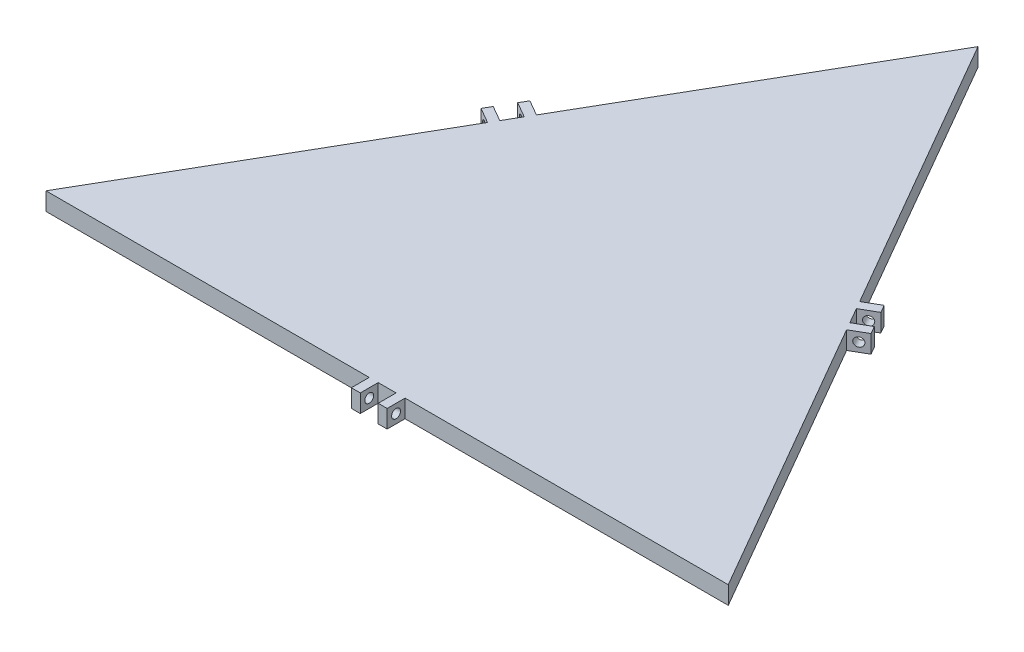
ISO-10303-21;
HEADER;
FILE_DESCRIPTION(('STEP AP214'),'2;1');
FILE_NAME('part.step','',(''),(''),'','','');
FILE_SCHEMA(('AUTOMOTIVE_DESIGN { 1 0 10303 214 1 1 1 1 }'));
ENDSEC;
DATA;
#1=APPLICATION_CONTEXT('core data for automotive mechanical design processes');
#2=APPLICATION_PROTOCOL_DEFINITION('international standard','automotive_design',2000,#1);
#3=PRODUCT_CONTEXT('',#1,'mechanical');
#4=PRODUCT('Part','Part','',(#3));
#5=PRODUCT_RELATED_PRODUCT_CATEGORY('part','',(#4));
#6=PRODUCT_DEFINITION_FORMATION('','',#4);
#7=PRODUCT_DEFINITION_CONTEXT('part definition',#1,'design');
#8=PRODUCT_DEFINITION('design','',#6,#7);
#9=PRODUCT_DEFINITION_SHAPE('','',#8);
#10=(LENGTH_UNIT() NAMED_UNIT(*) SI_UNIT(.MILLI.,.METRE.));
#11=(NAMED_UNIT(*) PLANE_ANGLE_UNIT() SI_UNIT($,.RADIAN.));
#12=(NAMED_UNIT(*) SI_UNIT($,.STERADIAN.) SOLID_ANGLE_UNIT());
#13=UNCERTAINTY_MEASURE_WITH_UNIT(LENGTH_MEASURE(1.E-05),#10,'distance_accuracy_value','');
#14=(GEOMETRIC_REPRESENTATION_CONTEXT(3) GLOBAL_UNCERTAINTY_ASSIGNED_CONTEXT((#13)) GLOBAL_UNIT_ASSIGNED_CONTEXT((#10,
#11,#12)) REPRESENTATION_CONTEXT('',''));
#15=CARTESIAN_POINT('',(0.,0.,0.));
#16=DIRECTION('',(0.,0.,1.));
#17=DIRECTION('',(1.,0.,0.));
#18=AXIS2_PLACEMENT_3D('',#15,#16,#17);
#19=CARTESIAN_POINT('',(-381.1,10.,0.));
#20=DIRECTION('',(0.866025403784439,0.,0.5));
#21=DIRECTION('',(0.5,0.,-0.866025403784439));
#22=AXIS2_PLACEMENT_3D('',#19,#20,#21);
#23=PLANE('',#22);
#24=DIRECTION('',(-0.5,0.,0.866025403784439));
#25=VECTOR('',#24,1.);
#26=CARTESIAN_POINT('',(-381.1,0.,0.));
#27=LINE('',#26,#25);
#28=CARTESIAN_POINT('',(-283.325,0.,-169.351267710047));
#29=VERTEX_POINT('',#28);
#30=CARTESIAN_POINT('',(-288.325,0.,-160.691013672203));
#31=VERTEX_POINT('',#30);
#32=EDGE_CURVE('E525',#29,#31,#27,.T.);
#33=ORIENTED_EDGE('',*,*,#32,.T.);
#34=DIRECTION('',(0.,1.,0.));
#35=VECTOR('',#34,1.);
#36=CARTESIAN_POINT('',(-288.325,10.,-160.691013672203));
#37=LINE('',#36,#35);
#38=CARTESIAN_POINT('',(-288.325,10.,-160.691013672203));
#39=VERTEX_POINT('',#38);
#40=EDGE_CURVE('E68',#31,#39,#37,.T.);
#41=ORIENTED_EDGE('',*,*,#40,.T.);
#42=DIRECTION('',(-0.5,0.,0.866025403784439));
#43=VECTOR('',#42,1.);
#44=CARTESIAN_POINT('',(-381.1,10.,0.));
#45=LINE('',#44,#43);
#46=CARTESIAN_POINT('',(-283.325,10.,-169.351267710047));
#47=VERTEX_POINT('',#46);
#48=EDGE_CURVE('E509',#47,#39,#45,.T.);
#49=ORIENTED_EDGE('',*,*,#48,.F.);
#50=DIRECTION('',(0.,-1.,0.));
#51=VECTOR('',#50,1.);
#52=CARTESIAN_POINT('',(-283.325,10.,-169.351267710047));
#53=LINE('',#52,#51);
#54=EDGE_CURVE('E236',#47,#29,#53,.T.);
#55=ORIENTED_EDGE('',*,*,#54,.T.);
#56=EDGE_LOOP('',(#33,#41,#49,#55));
#57=FACE_BOUND('',#56,.T.);
#58=ADVANCED_FACE('F44',(#57),#23,.F.);
#59=CARTESIAN_POINT('',(-290.825,10.,-156.36088665328));
#60=VERTEX_POINT('',#59);
#61=CARTESIAN_POINT('',(-381.1,10.,0.));
#62=VERTEX_POINT('',#61);
#63=EDGE_CURVE('E60',#60,#62,#45,.T.);
#64=ORIENTED_EDGE('',*,*,#63,.F.);
#65=DIRECTION('',(0.,-1.,0.));
#66=VECTOR('',#65,1.);
#67=CARTESIAN_POINT('',(-290.825,10.,-156.36088665328));
#68=LINE('',#67,#66);
#69=CARTESIAN_POINT('',(-290.825,0.,-156.36088665328));
#70=VERTEX_POINT('',#69);
#71=EDGE_CURVE('E248',#60,#70,#68,.T.);
#72=ORIENTED_EDGE('',*,*,#71,.T.);
#73=CARTESIAN_POINT('',(-381.1,0.,0.));
#74=VERTEX_POINT('',#73);
#75=EDGE_CURVE('E519',#70,#74,#27,.T.);
#76=ORIENTED_EDGE('',*,*,#75,.T.);
#77=DIRECTION('',(0.,-1.,0.));
#78=VECTOR('',#77,1.);
#79=CARTESIAN_POINT('',(-381.1,10.,0.));
#80=LINE('',#79,#78);
#81=EDGE_CURVE('E508',#62,#74,#80,.T.);
#82=ORIENTED_EDGE('',*,*,#81,.F.);
#83=EDGE_LOOP('',(#64,#72,#76,#82));
#84=FACE_BOUND('',#83,.T.);
#85=ADVANCED_FACE('F624',(#84),#23,.F.);
#86=CARTESIAN_POINT('',(0.,10.,0.));
#87=DIRECTION('',(0.,0.,-1.));
#88=DIRECTION('',(-1.,0.,0.));
#89=AXIS2_PLACEMENT_3D('',#86,#87,#88);
#90=PLANE('',#89);
#91=DIRECTION('',(1.,0.,0.));
#92=VECTOR('',#91,1.);
#93=CARTESIAN_POINT('',(0.,0.,0.));
#94=LINE('',#93,#92);
#95=CARTESIAN_POINT('',(-195.55,0.,0.));
#96=VERTEX_POINT('',#95);
#97=CARTESIAN_POINT('',(-185.55,0.,0.));
#98=VERTEX_POINT('',#97);
#99=EDGE_CURVE('E515',#96,#98,#94,.T.);
#100=ORIENTED_EDGE('',*,*,#99,.T.);
#101=DIRECTION('',(0.,1.,0.));
#102=VECTOR('',#101,1.);
#103=CARTESIAN_POINT('',(-185.55,10.,0.));
#104=LINE('',#103,#102);
#105=CARTESIAN_POINT('',(-185.55,10.,0.));
#106=VERTEX_POINT('',#105);
#107=EDGE_CURVE('E326',#98,#106,#104,.T.);
#108=ORIENTED_EDGE('',*,*,#107,.T.);
#109=DIRECTION('',(1.,0.,0.));
#110=VECTOR('',#109,1.);
#111=CARTESIAN_POINT('',(0.,10.,0.));
#112=LINE('',#111,#110);
#113=CARTESIAN_POINT('',(-195.55,10.,0.));
#114=VERTEX_POINT('',#113);
#115=EDGE_CURVE('E497',#114,#106,#112,.T.);
#116=ORIENTED_EDGE('',*,*,#115,.F.);
#117=DIRECTION('',(0.,-1.,0.));
#118=VECTOR('',#117,1.);
#119=CARTESIAN_POINT('',(-195.55,10.,0.));
#120=LINE('',#119,#118);
#121=EDGE_CURVE('E365',#114,#96,#120,.T.);
#122=ORIENTED_EDGE('',*,*,#121,.T.);
#123=EDGE_LOOP('',(#100,#108,#116,#122));
#124=FACE_BOUND('',#123,.T.);
#125=ADVANCED_FACE('F609',(#124),#90,.F.);
#126=CARTESIAN_POINT('',(-180.55,10.,0.));
#127=VERTEX_POINT('',#126);
#128=CARTESIAN_POINT('',(0.,10.,0.));
#129=VERTEX_POINT('',#128);
#130=EDGE_CURVE('E498',#127,#129,#112,.T.);
#131=ORIENTED_EDGE('',*,*,#130,.F.);
#132=DIRECTION('',(0.,-1.,0.));
#133=VECTOR('',#132,1.);
#134=CARTESIAN_POINT('',(-180.55,10.,0.));
#135=LINE('',#134,#133);
#136=CARTESIAN_POINT('',(-180.55,0.,0.));
#137=VERTEX_POINT('',#136);
#138=EDGE_CURVE('E332',#127,#137,#135,.T.);
#139=ORIENTED_EDGE('',*,*,#138,.T.);
#140=CARTESIAN_POINT('',(0.,0.,0.));
#141=VERTEX_POINT('',#140);
#142=EDGE_CURVE('E491',#137,#141,#94,.T.);
#143=ORIENTED_EDGE('',*,*,#142,.T.);
#144=DIRECTION('',(0.,-1.,0.));
#145=VECTOR('',#144,1.);
#146=CARTESIAN_POINT('',(0.,10.,0.));
#147=LINE('',#146,#145);
#148=EDGE_CURVE('E11',#129,#141,#147,.T.);
#149=ORIENTED_EDGE('',*,*,#148,.F.);
#150=EDGE_LOOP('',(#131,#139,#143,#149));
#151=FACE_BOUND('',#150,.T.);
#152=ADVANCED_FACE('F590',(#151),#90,.F.);
#153=CARTESIAN_POINT('',(-190.55,10.,-330.04228138225));
#154=DIRECTION('',(-0.866025403784438,0.,0.5));
#155=DIRECTION('',(0.5,0.,0.866025403784439));
#156=AXIS2_PLACEMENT_3D('',#153,#154,#155);
#157=PLANE('',#156);
#158=DIRECTION('',(0.,1.,0.));
#159=VECTOR('',#158,1.);
#160=CARTESIAN_POINT('',(-92.7750000000001,10.,-160.691013672203));
#161=LINE('',#160,#159);
#162=CARTESIAN_POINT('',(-92.7750000000001,0.,-160.691013672203));
#163=VERTEX_POINT('',#162);
#164=CARTESIAN_POINT('',(-92.7750000000001,10.,-160.691013672203));
#165=VERTEX_POINT('',#164);
#166=EDGE_CURVE('E438',#163,#165,#161,.T.);
#167=ORIENTED_EDGE('',*,*,#166,.F.);
#168=DIRECTION('',(-0.5,0.,-0.866025403784439));
#169=VECTOR('',#168,1.);
#170=CARTESIAN_POINT('',(-190.55,0.,-330.04228138225));
#171=LINE('',#170,#169);
#172=CARTESIAN_POINT('',(-97.7750000000001,0.,-169.351267710047));
#173=VERTEX_POINT('',#172);
#174=EDGE_CURVE('E520',#163,#173,#171,.T.);
#175=ORIENTED_EDGE('',*,*,#174,.T.);
#176=DIRECTION('',(0.,-1.,0.));
#177=VECTOR('',#176,1.);
#178=CARTESIAN_POINT('',(-97.7750000000001,10.,-169.351267710047));
#179=LINE('',#178,#177);
#180=CARTESIAN_POINT('',(-97.7750000000001,10.,-169.351267710047));
#181=VERTEX_POINT('',#180);
#182=EDGE_CURVE('E443',#181,#173,#179,.T.);
#183=ORIENTED_EDGE('',*,*,#182,.F.);
#184=DIRECTION('',(-0.5,0.,-0.866025403784439));
#185=VECTOR('',#184,1.);
#186=CARTESIAN_POINT('',(-190.55,10.,-330.04228138225));
#187=LINE('',#186,#185);
#188=EDGE_CURVE('E503',#165,#181,#187,.T.);
#189=ORIENTED_EDGE('',*,*,#188,.F.);
#190=EDGE_LOOP('',(#167,#175,#183,#189));
#191=FACE_BOUND('',#190,.T.);
#192=ADVANCED_FACE('F556',(#191),#157,.F.);
#193=DIRECTION('',(0.,-1.,0.));
#194=VECTOR('',#193,1.);
#195=CARTESIAN_POINT('',(-90.2750000000001,10.,-156.36088665328));
#196=LINE('',#195,#194);
#197=CARTESIAN_POINT('',(-90.2750000000001,10.,-156.36088665328));
#198=VERTEX_POINT('',#197);
#199=CARTESIAN_POINT('',(-90.2750000000001,0.,-156.36088665328));
#200=VERTEX_POINT('',#199);
#201=EDGE_CURVE('E434',#198,#200,#196,.T.);
#202=ORIENTED_EDGE('',*,*,#201,.F.);
#203=EDGE_CURVE('E499',#129,#198,#187,.T.);
#204=ORIENTED_EDGE('',*,*,#203,.F.);
#205=ORIENTED_EDGE('',*,*,#148,.T.);
#206=EDGE_CURVE('E516',#141,#200,#171,.T.);
#207=ORIENTED_EDGE('',*,*,#206,.T.);
#208=EDGE_LOOP('',(#202,#204,#205,#207));
#209=FACE_BOUND('',#208,.T.);
#210=ADVANCED_FACE('F594',(#209),#157,.F.);
#211=DIRECTION('',(0.,1.,0.));
#212=VECTOR('',#211,1.);
#213=CARTESIAN_POINT('',(-100.275,10.,-173.681394728969));
#214=LINE('',#213,#212);
#215=CARTESIAN_POINT('',(-100.275,0.,-173.681394728969));
#216=VERTEX_POINT('',#215);
#217=CARTESIAN_POINT('',(-100.275,10.,-173.681394728969));
#218=VERTEX_POINT('',#217);
#219=EDGE_CURVE('E460',#216,#218,#214,.T.);
#220=ORIENTED_EDGE('',*,*,#219,.F.);
#221=CARTESIAN_POINT('',(-190.55,0.,-330.04228138225));
#222=VERTEX_POINT('',#221);
#223=EDGE_CURVE('E514',#216,#222,#171,.T.);
#224=ORIENTED_EDGE('',*,*,#223,.T.);
#225=DIRECTION('',(0.,-1.,0.));
#226=VECTOR('',#225,1.);
#227=CARTESIAN_POINT('',(-190.55,10.,-330.04228138225));
#228=LINE('',#227,#226);
#229=CARTESIAN_POINT('',(-190.55,10.,-330.04228138225));
#230=VERTEX_POINT('',#229);
#231=EDGE_CURVE('E53',#230,#222,#228,.T.);
#232=ORIENTED_EDGE('',*,*,#231,.F.);
#233=EDGE_CURVE('E496',#218,#230,#187,.T.);
#234=ORIENTED_EDGE('',*,*,#233,.F.);
#235=EDGE_LOOP('',(#220,#224,#232,#234));
#236=FACE_BOUND('',#235,.T.);
#237=ADVANCED_FACE('F565',(#236),#157,.F.);
#238=CARTESIAN_POINT('',(-200.55,0.,0.));
#239=VERTEX_POINT('',#238);
#240=EDGE_CURVE('E510',#74,#239,#94,.T.);
#241=ORIENTED_EDGE('',*,*,#240,.T.);
#242=DIRECTION('',(0.,1.,0.));
#243=VECTOR('',#242,1.);
#244=CARTESIAN_POINT('',(-200.55,10.,0.));
#245=LINE('',#244,#243);
#246=CARTESIAN_POINT('',(-200.55,10.,0.));
#247=VERTEX_POINT('',#246);
#248=EDGE_CURVE('E371',#239,#247,#245,.T.);
#249=ORIENTED_EDGE('',*,*,#248,.T.);
#250=EDGE_CURVE('E492',#62,#247,#112,.T.);
#251=ORIENTED_EDGE('',*,*,#250,.F.);
#252=ORIENTED_EDGE('',*,*,#81,.T.);
#253=EDGE_LOOP('',(#241,#249,#251,#252));
#254=FACE_BOUND('',#253,.T.);
#255=ADVANCED_FACE('F46',(#254),#90,.F.);
#256=CARTESIAN_POINT('',(-280.825,0.,-173.681394728969));
#257=VERTEX_POINT('',#256);
#258=EDGE_CURVE('E521',#222,#257,#27,.T.);
#259=ORIENTED_EDGE('',*,*,#258,.T.);
#260=DIRECTION('',(0.,1.,0.));
#261=VECTOR('',#260,1.);
#262=CARTESIAN_POINT('',(-280.825,10.,-173.681394728969));
#263=LINE('',#262,#261);
#264=CARTESIAN_POINT('',(-280.825,10.,-173.681394728969));
#265=VERTEX_POINT('',#264);
#266=EDGE_CURVE('E280',#257,#265,#263,.T.);
#267=ORIENTED_EDGE('',*,*,#266,.T.);
#268=EDGE_CURVE('E504',#230,#265,#45,.T.);
#269=ORIENTED_EDGE('',*,*,#268,.F.);
#270=ORIENTED_EDGE('',*,*,#231,.T.);
#271=EDGE_LOOP('',(#259,#267,#269,#270));
#272=FACE_BOUND('',#271,.T.);
#273=ADVANCED_FACE('F534',(#272),#23,.F.);
#274=CARTESIAN_POINT('',(0.,10.,0.));
#275=DIRECTION('',(0.,-1.,0.));
#276=DIRECTION('',(0.,0.,-1.));
#277=AXIS2_PLACEMENT_3D('',#274,#275,#276);
#278=PLANE('',#277);
#279=ORIENTED_EDGE('',*,*,#250,.T.);
#280=DIRECTION('',(0.,0.,-1.));
#281=VECTOR('',#280,1.);
#282=CARTESIAN_POINT('',(-200.55,10.,10.));
#283=LINE('',#282,#281);
#284=CARTESIAN_POINT('',(-200.55,10.,10.));
#285=VERTEX_POINT('',#284);
#286=EDGE_CURVE('E395',#285,#247,#283,.T.);
#287=ORIENTED_EDGE('',*,*,#286,.F.);
#288=DIRECTION('',(1.,0.,0.));
#289=VECTOR('',#288,1.);
#290=CARTESIAN_POINT('',(-195.55,10.,10.));
#291=LINE('',#290,#289);
#292=CARTESIAN_POINT('',(-195.55,10.,10.));
#293=VERTEX_POINT('',#292);
#294=EDGE_CURVE('E370',#285,#293,#291,.T.);
#295=ORIENTED_EDGE('',*,*,#294,.T.);
#296=DIRECTION('',(0.,0.,-1.));
#297=VECTOR('',#296,1.);
#298=CARTESIAN_POINT('',(-195.55,10.,10.));
#299=LINE('',#298,#297);
#300=EDGE_CURVE('E398',#293,#114,#299,.T.);
#301=ORIENTED_EDGE('',*,*,#300,.T.);
#302=ORIENTED_EDGE('',*,*,#115,.T.);
#303=DIRECTION('',(0.,0.,-1.));
#304=VECTOR('',#303,1.);
#305=CARTESIAN_POINT('',(-185.55,10.,10.));
#306=LINE('',#305,#304);
#307=CARTESIAN_POINT('',(-185.55,10.,10.));
#308=VERTEX_POINT('',#307);
#309=EDGE_CURVE('E344',#308,#106,#306,.T.);
#310=ORIENTED_EDGE('',*,*,#309,.F.);
#311=DIRECTION('',(1.,0.,0.));
#312=VECTOR('',#311,1.);
#313=CARTESIAN_POINT('',(-185.55,10.,10.));
#314=LINE('',#313,#312);
#315=CARTESIAN_POINT('',(-180.55,10.,10.));
#316=VERTEX_POINT('',#315);
#317=EDGE_CURVE('E340',#308,#316,#314,.T.);
#318=ORIENTED_EDGE('',*,*,#317,.T.);
#319=DIRECTION('',(0.,0.,-1.));
#320=VECTOR('',#319,1.);
#321=CARTESIAN_POINT('',(-180.55,10.,10.));
#322=LINE('',#321,#320);
#323=EDGE_CURVE('E353',#316,#127,#322,.T.);
#324=ORIENTED_EDGE('',*,*,#323,.T.);
#325=ORIENTED_EDGE('',*,*,#130,.T.);
#326=ORIENTED_EDGE('',*,*,#203,.T.);
#327=DIRECTION('',(-0.866025403784438,0.,0.5));
#328=VECTOR('',#327,1.);
#329=CARTESIAN_POINT('',(-81.6147459621558,10.,-161.36088665328));
#330=LINE('',#329,#328);
#331=CARTESIAN_POINT('',(-81.6147459621558,10.,-161.36088665328));
#332=VERTEX_POINT('',#331);
#333=EDGE_CURVE('E421',#332,#198,#330,.T.);
#334=ORIENTED_EDGE('',*,*,#333,.F.);
#335=DIRECTION('',(0.500000000000001,0.,0.866025403784438));
#336=VECTOR('',#335,1.);
#337=CARTESIAN_POINT('',(-84.1147459621558,10.,-165.691013672203));
#338=LINE('',#337,#336);
#339=CARTESIAN_POINT('',(-84.1147459621558,10.,-165.691013672203));
#340=VERTEX_POINT('',#339);
#341=EDGE_CURVE('E449',#340,#332,#338,.T.);
#342=ORIENTED_EDGE('',*,*,#341,.F.);
#343=DIRECTION('',(-0.866025403784438,0.,0.5));
#344=VECTOR('',#343,1.);
#345=CARTESIAN_POINT('',(-84.1147459621558,10.,-165.691013672203));
#346=LINE('',#345,#344);
#347=EDGE_CURVE('E417',#340,#165,#346,.T.);
#348=ORIENTED_EDGE('',*,*,#347,.T.);
#349=ORIENTED_EDGE('',*,*,#188,.T.);
#350=DIRECTION('',(-0.866025403784438,0.,0.5));
#351=VECTOR('',#350,1.);
#352=CARTESIAN_POINT('',(-89.1147459621558,10.,-174.351267710047));
#353=LINE('',#352,#351);
#354=CARTESIAN_POINT('',(-89.1147459621558,10.,-174.351267710047));
#355=VERTEX_POINT('',#354);
#356=EDGE_CURVE('E469',#355,#181,#353,.T.);
#357=ORIENTED_EDGE('',*,*,#356,.F.);
#358=DIRECTION('',(0.500000000000001,0.,0.866025403784438));
#359=VECTOR('',#358,1.);
#360=CARTESIAN_POINT('',(-89.1147459621558,10.,-174.351267710047));
#361=LINE('',#360,#359);
#362=CARTESIAN_POINT('',(-91.6147459621558,10.,-178.681394728969));
#363=VERTEX_POINT('',#362);
#364=EDGE_CURVE('E466',#363,#355,#361,.T.);
#365=ORIENTED_EDGE('',*,*,#364,.F.);
#366=DIRECTION('',(-0.866025403784438,0.,0.5));
#367=VECTOR('',#366,1.);
#368=CARTESIAN_POINT('',(-91.6147459621558,10.,-178.681394728969));
#369=LINE('',#368,#367);
#370=EDGE_CURVE('E479',#363,#218,#369,.T.);
#371=ORIENTED_EDGE('',*,*,#370,.T.);
#372=ORIENTED_EDGE('',*,*,#233,.T.);
#373=ORIENTED_EDGE('',*,*,#268,.T.);
#374=DIRECTION('',(0.866025403784439,0.,0.5));
#375=VECTOR('',#374,1.);
#376=CARTESIAN_POINT('',(-289.485254037844,10.,-178.681394728969));
#377=LINE('',#376,#375);
#378=CARTESIAN_POINT('',(-289.485254037844,10.,-178.681394728969));
#379=VERTEX_POINT('',#378);
#380=EDGE_CURVE('E304',#379,#265,#377,.T.);
#381=ORIENTED_EDGE('',*,*,#380,.F.);
#382=DIRECTION('',(-0.5,0.,0.866025403784438));
#383=VECTOR('',#382,1.);
#384=CARTESIAN_POINT('',(-291.985254037844,10.,-174.351267710047));
#385=LINE('',#384,#383);
#386=CARTESIAN_POINT('',(-291.985254037844,10.,-174.351267710047));
#387=VERTEX_POINT('',#386);
#388=EDGE_CURVE('E279',#379,#387,#385,.T.);
#389=ORIENTED_EDGE('',*,*,#388,.T.);
#390=DIRECTION('',(0.866025403784439,0.,0.5));
#391=VECTOR('',#390,1.);
#392=CARTESIAN_POINT('',(-291.985254037844,10.,-174.351267710047));
#393=LINE('',#392,#391);
#394=EDGE_CURVE('E307',#387,#47,#393,.T.);
#395=ORIENTED_EDGE('',*,*,#394,.T.);
#396=ORIENTED_EDGE('',*,*,#48,.T.);
#397=DIRECTION('',(0.866025403784439,0.,0.5));
#398=VECTOR('',#397,1.);
#399=CARTESIAN_POINT('',(-296.985254037844,10.,-165.691013672203));
#400=LINE('',#399,#398);
#401=CARTESIAN_POINT('',(-296.985254037844,10.,-165.691013672203));
#402=VERTEX_POINT('',#401);
#403=EDGE_CURVE('E262',#402,#39,#400,.T.);
#404=ORIENTED_EDGE('',*,*,#403,.F.);
#405=DIRECTION('',(-0.5,0.,0.866025403784438));
#406=VECTOR('',#405,1.);
#407=CARTESIAN_POINT('',(-296.985254037844,10.,-165.691013672203));
#408=LINE('',#407,#406);
#409=CARTESIAN_POINT('',(-299.485254037844,10.,-161.36088665328));
#410=VERTEX_POINT('',#409);
#411=EDGE_CURVE('E246',#402,#410,#408,.T.);
#412=ORIENTED_EDGE('',*,*,#411,.T.);
#413=DIRECTION('',(0.866025403784439,0.,0.5));
#414=VECTOR('',#413,1.);
#415=CARTESIAN_POINT('',(-299.485254037844,10.,-161.36088665328));
#416=LINE('',#415,#414);
#417=EDGE_CURVE('E270',#410,#60,#416,.T.);
#418=ORIENTED_EDGE('',*,*,#417,.T.);
#419=ORIENTED_EDGE('',*,*,#63,.T.);
#420=EDGE_LOOP('',(#279,#287,#295,#301,#302,#310,#318,#324,#325,#326,#334,#342,#348,#349,#357,
#365,#371,#372,#373,#381,#389,#395,#396,#404,#412,#418,#419));
#421=FACE_BOUND('',#420,.T.);
#422=ADVANCED_FACE('F544',(#421),#278,.F.);
#423=CARTESIAN_POINT('',(0.,0.,0.));
#424=DIRECTION('',(0.,-1.,0.));
#425=DIRECTION('',(0.,0.,-1.));
#426=AXIS2_PLACEMENT_3D('',#423,#424,#425);
#427=PLANE('',#426);
#428=ORIENTED_EDGE('',*,*,#99,.F.);
#429=DIRECTION('',(0.,0.,-1.));
#430=VECTOR('',#429,1.);
#431=CARTESIAN_POINT('',(-195.55,0.,10.));
#432=LINE('',#431,#430);
#433=CARTESIAN_POINT('',(-195.55,0.,10.));
#434=VERTEX_POINT('',#433);
#435=EDGE_CURVE('E383',#434,#96,#432,.T.);
#436=ORIENTED_EDGE('',*,*,#435,.F.);
#437=DIRECTION('',(-1.,0.,0.));
#438=VECTOR('',#437,1.);
#439=CARTESIAN_POINT('',(-195.55,0.,10.));
#440=LINE('',#439,#438);
#441=CARTESIAN_POINT('',(-200.55,0.,10.));
#442=VERTEX_POINT('',#441);
#443=EDGE_CURVE('E379',#434,#442,#440,.T.);
#444=ORIENTED_EDGE('',*,*,#443,.T.);
#445=DIRECTION('',(0.,0.,-1.));
#446=VECTOR('',#445,1.);
#447=CARTESIAN_POINT('',(-200.55,0.,10.));
#448=LINE('',#447,#446);
#449=EDGE_CURVE('E392',#442,#239,#448,.T.);
#450=ORIENTED_EDGE('',*,*,#449,.T.);
#451=ORIENTED_EDGE('',*,*,#240,.F.);
#452=ORIENTED_EDGE('',*,*,#75,.F.);
#453=DIRECTION('',(0.866025403784439,0.,0.5));
#454=VECTOR('',#453,1.);
#455=CARTESIAN_POINT('',(-299.485254037844,0.,-161.36088665328));
#456=LINE('',#455,#454);
#457=CARTESIAN_POINT('',(-299.485254037844,0.,-161.36088665328));
#458=VERTEX_POINT('',#457);
#459=EDGE_CURVE('E237',#458,#70,#456,.T.);
#460=ORIENTED_EDGE('',*,*,#459,.F.);
#461=DIRECTION('',(0.5,0.,-0.866025403784438));
#462=VECTOR('',#461,1.);
#463=CARTESIAN_POINT('',(-296.985254037844,0.,-165.691013672203));
#464=LINE('',#463,#462);
#465=CARTESIAN_POINT('',(-296.985254037844,0.,-165.691013672203));
#466=VERTEX_POINT('',#465);
#467=EDGE_CURVE('E243',#458,#466,#464,.T.);
#468=ORIENTED_EDGE('',*,*,#467,.T.);
#469=DIRECTION('',(0.866025403784439,0.,0.5));
#470=VECTOR('',#469,1.);
#471=CARTESIAN_POINT('',(-296.985254037844,0.,-165.691013672203));
#472=LINE('',#471,#470);
#473=EDGE_CURVE('E226',#466,#31,#472,.T.);
#474=ORIENTED_EDGE('',*,*,#473,.T.);
#475=ORIENTED_EDGE('',*,*,#32,.F.);
#476=DIRECTION('',(0.866025403784439,0.,0.5));
#477=VECTOR('',#476,1.);
#478=CARTESIAN_POINT('',(-291.985254037844,0.,-174.351267710047));
#479=LINE('',#478,#477);
#480=CARTESIAN_POINT('',(-291.985254037844,0.,-174.351267710047));
#481=VERTEX_POINT('',#480);
#482=EDGE_CURVE('E292',#481,#29,#479,.T.);
#483=ORIENTED_EDGE('',*,*,#482,.F.);
#484=DIRECTION('',(0.5,0.,-0.866025403784438));
#485=VECTOR('',#484,1.);
#486=CARTESIAN_POINT('',(-291.985254037844,0.,-174.351267710047));
#487=LINE('',#486,#485);
#488=CARTESIAN_POINT('',(-289.485254037844,0.,-178.681394728969));
#489=VERTEX_POINT('',#488);
#490=EDGE_CURVE('E288',#481,#489,#487,.T.);
#491=ORIENTED_EDGE('',*,*,#490,.T.);
#492=DIRECTION('',(0.866025403784439,0.,0.5));
#493=VECTOR('',#492,1.);
#494=CARTESIAN_POINT('',(-289.485254037844,0.,-178.681394728969));
#495=LINE('',#494,#493);
#496=EDGE_CURVE('E301',#489,#257,#495,.T.);
#497=ORIENTED_EDGE('',*,*,#496,.T.);
#498=ORIENTED_EDGE('',*,*,#258,.F.);
#499=ORIENTED_EDGE('',*,*,#223,.F.);
#500=DIRECTION('',(-0.866025403784438,0.,0.5));
#501=VECTOR('',#500,1.);
#502=CARTESIAN_POINT('',(-91.6147459621558,0.,-178.681394728969));
#503=LINE('',#502,#501);
#504=CARTESIAN_POINT('',(-91.6147459621558,0.,-178.681394728969));
#505=VERTEX_POINT('',#504);
#506=EDGE_CURVE('E483',#505,#216,#503,.T.);
#507=ORIENTED_EDGE('',*,*,#506,.F.);
#508=DIRECTION('',(-0.500000000000001,0.,-0.866025403784438));
#509=VECTOR('',#508,1.);
#510=CARTESIAN_POINT('',(-89.1147459621558,0.,-174.351267710047));
#511=LINE('',#510,#509);
#512=CARTESIAN_POINT('',(-89.1147459621558,0.,-174.351267710047));
#513=VERTEX_POINT('',#512);
#514=EDGE_CURVE('E459',#513,#505,#511,.T.);
#515=ORIENTED_EDGE('',*,*,#514,.F.);
#516=DIRECTION('',(-0.866025403784438,0.,0.5));
#517=VECTOR('',#516,1.);
#518=CARTESIAN_POINT('',(-89.1147459621558,0.,-174.351267710047));
#519=LINE('',#518,#517);
#520=EDGE_CURVE('E487',#513,#173,#519,.T.);
#521=ORIENTED_EDGE('',*,*,#520,.T.);
#522=ORIENTED_EDGE('',*,*,#174,.F.);
#523=DIRECTION('',(-0.866025403784438,0.,0.5));
#524=VECTOR('',#523,1.);
#525=CARTESIAN_POINT('',(-84.1147459621558,0.,-165.691013672203));
#526=LINE('',#525,#524);
#527=CARTESIAN_POINT('',(-84.1147459621558,0.,-165.691013672203));
#528=VERTEX_POINT('',#527);
#529=EDGE_CURVE('E429',#528,#163,#526,.T.);
#530=ORIENTED_EDGE('',*,*,#529,.F.);
#531=DIRECTION('',(-0.500000000000001,0.,-0.866025403784438));
#532=VECTOR('',#531,1.);
#533=CARTESIAN_POINT('',(-84.1147459621558,0.,-165.691013672203));
#534=LINE('',#533,#532);
#535=CARTESIAN_POINT('',(-81.6147459621558,0.,-161.36088665328));
#536=VERTEX_POINT('',#535);
#537=EDGE_CURVE('E433',#536,#528,#534,.T.);
#538=ORIENTED_EDGE('',*,*,#537,.F.);
#539=DIRECTION('',(-0.866025403784438,0.,0.5));
#540=VECTOR('',#539,1.);
#541=CARTESIAN_POINT('',(-81.6147459621558,0.,-161.36088665328));
#542=LINE('',#541,#540);
#543=EDGE_CURVE('E425',#536,#200,#542,.T.);
#544=ORIENTED_EDGE('',*,*,#543,.T.);
#545=ORIENTED_EDGE('',*,*,#206,.F.);
#546=ORIENTED_EDGE('',*,*,#142,.F.);
#547=DIRECTION('',(0.,0.,-1.));
#548=VECTOR('',#547,1.);
#549=CARTESIAN_POINT('',(-180.55,0.,10.));
#550=LINE('',#549,#548);
#551=CARTESIAN_POINT('',(-180.55,0.,10.));
#552=VERTEX_POINT('',#551);
#553=EDGE_CURVE('E357',#552,#137,#550,.T.);
#554=ORIENTED_EDGE('',*,*,#553,.F.);
#555=DIRECTION('',(-1.,0.,0.));
#556=VECTOR('',#555,1.);
#557=CARTESIAN_POINT('',(-185.55,0.,10.));
#558=LINE('',#557,#556);
#559=CARTESIAN_POINT('',(-185.55,0.,10.));
#560=VERTEX_POINT('',#559);
#561=EDGE_CURVE('E331',#552,#560,#558,.T.);
#562=ORIENTED_EDGE('',*,*,#561,.T.);
#563=DIRECTION('',(0.,0.,-1.));
#564=VECTOR('',#563,1.);
#565=CARTESIAN_POINT('',(-185.55,0.,10.));
#566=LINE('',#565,#564);
#567=EDGE_CURVE('E361',#560,#98,#566,.T.);
#568=ORIENTED_EDGE('',*,*,#567,.T.);
#569=EDGE_LOOP('',(#428,#436,#444,#450,#451,#452,#460,#468,#474,#475,#483,#491,#497,#498,#499,
#507,#515,#521,#522,#530,#538,#544,#545,#546,#554,#562,#568));
#570=FACE_BOUND('',#569,.T.);
#571=ADVANCED_FACE('F251',(#570),#427,.T.);
#572=CARTESIAN_POINT('',(-89.1147459621558,10.,-174.351267710047));
#573=DIRECTION('',(-0.5,0.,-0.866025403784438));
#574=DIRECTION('',(-0.866025403784438,0.,0.5));
#575=AXIS2_PLACEMENT_3D('',#572,#573,#574);
#576=PLANE('',#575);
#577=CARTESIAN_POINT('',(-93.4448729810779,5.,-171.851267710047));
#578=DIRECTION('',(-0.5,0.,-0.866025403784438));
#579=DIRECTION('',(-0.866025403784438,0.,0.5));
#580=AXIS2_PLACEMENT_3D('',#577,#578,#579);
#581=CIRCLE('',#580,2.5);
#582=CARTESIAN_POINT('',(-95.609936490539,5.,-170.601267710047));
#583=VERTEX_POINT('',#582);
#584=EDGE_CURVE('E413',#583,#583,#581,.T.);
#585=ORIENTED_EDGE('',*,*,#584,.T.);
#586=EDGE_LOOP('',(#585));
#587=FACE_BOUND('',#586,.T.);
#588=ORIENTED_EDGE('',*,*,#182,.T.);
#589=ORIENTED_EDGE('',*,*,#520,.F.);
#590=DIRECTION('',(0.,-1.,0.));
#591=VECTOR('',#590,1.);
#592=CARTESIAN_POINT('',(-89.1147459621558,10.,-174.351267710047));
#593=LINE('',#592,#591);
#594=EDGE_CURVE('E455',#355,#513,#593,.T.);
#595=ORIENTED_EDGE('',*,*,#594,.F.);
#596=ORIENTED_EDGE('',*,*,#356,.T.);
#597=EDGE_LOOP('',(#588,#589,#595,#596));
#598=FACE_BOUND('',#597,.T.);
#599=ADVANCED_FACE('F559',(#587,#598),#576,.F.);
#600=CARTESIAN_POINT('',(-91.6147459621558,10.,-178.681394728969));
#601=DIRECTION('',(0.5,0.,0.866025403784438));
#602=DIRECTION('',(0.866025403784438,0.,-0.5));
#603=AXIS2_PLACEMENT_3D('',#600,#601,#602);
#604=PLANE('',#603);
#605=CARTESIAN_POINT('',(-95.9448729810779,5.,-176.181394728969));
#606=DIRECTION('',(0.500000000000001,0.,0.866025403784438));
#607=DIRECTION('',(0.866025403784438,0.,-0.500000000000001));
#608=AXIS2_PLACEMENT_3D('',#605,#606,#607);
#609=CIRCLE('',#608,2.5);
#610=CARTESIAN_POINT('',(-93.7798094716168,5.,-177.431394728969));
#611=VERTEX_POINT('',#610);
#612=EDGE_CURVE('E402',#611,#611,#609,.T.);
#613=ORIENTED_EDGE('',*,*,#612,.T.);
#614=EDGE_LOOP('',(#613));
#615=FACE_BOUND('',#614,.T.);
#616=ORIENTED_EDGE('',*,*,#219,.T.);
#617=ORIENTED_EDGE('',*,*,#370,.F.);
#618=DIRECTION('',(0.,1.,0.));
#619=VECTOR('',#618,1.);
#620=CARTESIAN_POINT('',(-91.6147459621558,10.,-178.681394728969));
#621=LINE('',#620,#619);
#622=EDGE_CURVE('E463',#505,#363,#621,.T.);
#623=ORIENTED_EDGE('',*,*,#622,.F.);
#624=ORIENTED_EDGE('',*,*,#506,.T.);
#625=EDGE_LOOP('',(#616,#617,#623,#624));
#626=FACE_BOUND('',#625,.T.);
#627=ADVANCED_FACE('F564',(#615,#626),#604,.F.);
#628=CARTESIAN_POINT('',(8.66025403784447,0.,-5.00000000000005));
#629=DIRECTION('',(0.866025403784438,0.,-0.500000000000001));
#630=DIRECTION('',(-0.500000000000001,0.,-0.866025403784438));
#631=AXIS2_PLACEMENT_3D('',#628,#629,#630);
#632=PLANE('',#631);
#633=ORIENTED_EDGE('',*,*,#594,.T.);
#634=ORIENTED_EDGE('',*,*,#514,.T.);
#635=ORIENTED_EDGE('',*,*,#622,.T.);
#636=ORIENTED_EDGE('',*,*,#364,.T.);
#637=EDGE_LOOP('',(#633,#634,#635,#636));
#638=FACE_BOUND('',#637,.T.);
#639=ADVANCED_FACE('F561',(#638),#632,.T.);
#640=CARTESIAN_POINT('',(-84.1147459621558,10.,-165.691013672203));
#641=DIRECTION('',(0.5,0.,0.866025403784438));
#642=DIRECTION('',(0.866025403784438,0.,-0.5));
#643=AXIS2_PLACEMENT_3D('',#640,#641,#642);
#644=PLANE('',#643);
#645=CARTESIAN_POINT('',(-88.4448729810779,5.,-163.191013672203));
#646=DIRECTION('',(0.5,0.,0.866025403784438));
#647=DIRECTION('',(0.866025403784438,0.,-0.5));
#648=AXIS2_PLACEMENT_3D('',#645,#646,#647);
#649=CIRCLE('',#648,2.5);
#650=CARTESIAN_POINT('',(-86.2798094716168,5.,-164.441013672203));
#651=VERTEX_POINT('',#650);
#652=EDGE_CURVE('E406',#651,#651,#649,.T.);
#653=ORIENTED_EDGE('',*,*,#652,.T.);
#654=EDGE_LOOP('',(#653));
#655=FACE_BOUND('',#654,.T.);
#656=ORIENTED_EDGE('',*,*,#166,.T.);
#657=ORIENTED_EDGE('',*,*,#347,.F.);
#658=DIRECTION('',(0.,1.,0.));
#659=VECTOR('',#658,1.);
#660=CARTESIAN_POINT('',(-84.1147459621558,10.,-165.691013672203));
#661=LINE('',#660,#659);
#662=EDGE_CURVE('E439',#528,#340,#661,.T.);
#663=ORIENTED_EDGE('',*,*,#662,.F.);
#664=ORIENTED_EDGE('',*,*,#529,.T.);
#665=EDGE_LOOP('',(#656,#657,#663,#664));
#666=FACE_BOUND('',#665,.T.);
#667=ADVANCED_FACE('F606',(#655,#666),#644,.F.);
#668=CARTESIAN_POINT('',(-81.6147459621558,10.,-161.36088665328));
#669=DIRECTION('',(-0.5,0.,-0.866025403784438));
#670=DIRECTION('',(-0.866025403784438,0.,0.5));
#671=AXIS2_PLACEMENT_3D('',#668,#669,#670);
#672=PLANE('',#671);
#673=CARTESIAN_POINT('',(-85.9448729810779,5.,-158.86088665328));
#674=DIRECTION('',(0.500000000000001,0.,0.866025403784438));
#675=DIRECTION('',(0.866025403784438,0.,-0.500000000000001));
#676=AXIS2_PLACEMENT_3D('',#673,#674,#675);
#677=CIRCLE('',#676,2.5);
#678=CARTESIAN_POINT('',(-83.7798094716168,5.,-160.11088665328));
#679=VERTEX_POINT('',#678);
#680=EDGE_CURVE('E401',#679,#679,#677,.T.);
#681=ORIENTED_EDGE('',*,*,#680,.F.);
#682=EDGE_LOOP('',(#681));
#683=FACE_BOUND('',#682,.T.);
#684=ORIENTED_EDGE('',*,*,#201,.T.);
#685=ORIENTED_EDGE('',*,*,#543,.F.);
#686=DIRECTION('',(0.,-1.,0.));
#687=VECTOR('',#686,1.);
#688=CARTESIAN_POINT('',(-81.6147459621558,10.,-161.36088665328));
#689=LINE('',#688,#687);
#690=EDGE_CURVE('E446',#332,#536,#689,.T.);
#691=ORIENTED_EDGE('',*,*,#690,.F.);
#692=ORIENTED_EDGE('',*,*,#333,.T.);
#693=EDGE_LOOP('',(#684,#685,#691,#692));
#694=FACE_BOUND('',#693,.T.);
#695=ADVANCED_FACE('F598',(#683,#694),#672,.F.);
#696=CARTESIAN_POINT('',(8.66025403784446,0.,-5.00000000000005));
#697=DIRECTION('',(-0.866025403784438,0.,0.500000000000001));
#698=DIRECTION('',(0.500000000000001,0.,0.866025403784438));
#699=AXIS2_PLACEMENT_3D('',#696,#697,#698);
#700=PLANE('',#699);
#701=ORIENTED_EDGE('',*,*,#662,.T.);
#702=ORIENTED_EDGE('',*,*,#341,.T.);
#703=ORIENTED_EDGE('',*,*,#690,.T.);
#704=ORIENTED_EDGE('',*,*,#537,.T.);
#705=EDGE_LOOP('',(#701,#702,#703,#704));
#706=FACE_BOUND('',#705,.T.);
#707=ADVANCED_FACE('F602',(#706),#700,.F.);
#708=CARTESIAN_POINT('',(-95.9448729810779,5.,-176.181394728969));
#709=DIRECTION('',(0.5,0.,0.866025403784438));
#710=DIRECTION('',(0.866025403784438,0.,-0.5));
#711=AXIS2_PLACEMENT_3D('',#708,#709,#710);
#712=CYLINDRICAL_SURFACE('',#711,2.5);
#713=ORIENTED_EDGE('',*,*,#680,.T.);
#714=EDGE_LOOP('',(#713));
#715=FACE_BOUND('',#714,.T.);
#716=ORIENTED_EDGE('',*,*,#652,.F.);
#717=EDGE_LOOP('',(#716));
#718=FACE_BOUND('',#717,.T.);
#719=ADVANCED_FACE('F694',(#715,#718),#712,.F.);
#720=ORIENTED_EDGE('',*,*,#612,.F.);
#721=EDGE_LOOP('',(#720));
#722=FACE_BOUND('',#721,.T.);
#723=ORIENTED_EDGE('',*,*,#584,.F.);
#724=EDGE_LOOP('',(#723));
#725=FACE_BOUND('',#724,.T.);
#726=ADVANCED_FACE('F733',(#722,#725),#712,.F.);
#727=CARTESIAN_POINT('',(-195.55,10.,10.));
#728=DIRECTION('',(1.,0.,0.));
#729=DIRECTION('',(0.,0.,-1.));
#730=AXIS2_PLACEMENT_3D('',#727,#728,#729);
#731=PLANE('',#730);
#732=CARTESIAN_POINT('',(-195.55,5.,5.00000000000006));
#733=DIRECTION('',(1.,0.,0.));
#734=DIRECTION('',(0.,0.,-1.));
#735=AXIS2_PLACEMENT_3D('',#732,#733,#734);
#736=CIRCLE('',#735,2.5);
#737=CARTESIAN_POINT('',(-195.55,5.,2.50000000000005));
#738=VERTEX_POINT('',#737);
#739=EDGE_CURVE('E322',#738,#738,#736,.T.);
#740=ORIENTED_EDGE('',*,*,#739,.F.);
#741=EDGE_LOOP('',(#740));
#742=FACE_BOUND('',#741,.T.);
#743=ORIENTED_EDGE('',*,*,#121,.F.);
#744=ORIENTED_EDGE('',*,*,#300,.F.);
#745=DIRECTION('',(0.,-1.,0.));
#746=VECTOR('',#745,1.);
#747=CARTESIAN_POINT('',(-195.55,10.,10.));
#748=LINE('',#747,#746);
#749=EDGE_CURVE('E366',#293,#434,#748,.T.);
#750=ORIENTED_EDGE('',*,*,#749,.T.);
#751=ORIENTED_EDGE('',*,*,#435,.T.);
#752=EDGE_LOOP('',(#743,#744,#750,#751));
#753=FACE_BOUND('',#752,.T.);
#754=ADVANCED_FACE('F613',(#742,#753),#731,.T.);
#755=CARTESIAN_POINT('',(-200.55,10.,10.));
#756=DIRECTION('',(-1.,0.,0.));
#757=DIRECTION('',(0.,0.,1.));
#758=AXIS2_PLACEMENT_3D('',#755,#756,#757);
#759=PLANE('',#758);
#760=CARTESIAN_POINT('',(-200.55,5.,5.00000000000006));
#761=DIRECTION('',(-1.,0.,0.));
#762=DIRECTION('',(0.,0.,1.));
#763=AXIS2_PLACEMENT_3D('',#760,#761,#762);
#764=CIRCLE('',#763,2.5);
#765=CARTESIAN_POINT('',(-200.55,5.,7.50000000000006));
#766=VERTEX_POINT('',#765);
#767=EDGE_CURVE('E310',#766,#766,#764,.T.);
#768=ORIENTED_EDGE('',*,*,#767,.F.);
#769=EDGE_LOOP('',(#768));
#770=FACE_BOUND('',#769,.T.);
#771=ORIENTED_EDGE('',*,*,#248,.F.);
#772=ORIENTED_EDGE('',*,*,#449,.F.);
#773=DIRECTION('',(0.,1.,0.));
#774=VECTOR('',#773,1.);
#775=CARTESIAN_POINT('',(-200.55,10.,10.));
#776=LINE('',#775,#774);
#777=EDGE_CURVE('E375',#442,#285,#776,.T.);
#778=ORIENTED_EDGE('',*,*,#777,.T.);
#779=ORIENTED_EDGE('',*,*,#286,.T.);
#780=EDGE_LOOP('',(#771,#772,#778,#779));
#781=FACE_BOUND('',#780,.T.);
#782=ADVANCED_FACE('F620',(#770,#781),#759,.T.);
#783=CARTESIAN_POINT('',(0.,0.,10.0000000000001));
#784=DIRECTION('',(0.,0.,1.));
#785=DIRECTION('',(-1.,0.,0.));
#786=AXIS2_PLACEMENT_3D('',#783,#784,#785);
#787=PLANE('',#786);
#788=ORIENTED_EDGE('',*,*,#749,.F.);
#789=ORIENTED_EDGE('',*,*,#294,.F.);
#790=ORIENTED_EDGE('',*,*,#777,.F.);
#791=ORIENTED_EDGE('',*,*,#443,.F.);
#792=EDGE_LOOP('',(#788,#789,#790,#791));
#793=FACE_BOUND('',#792,.T.);
#794=ADVANCED_FACE('F617',(#793),#787,.T.);
#795=CARTESIAN_POINT('',(-185.55,10.,10.));
#796=DIRECTION('',(-1.,0.,0.));
#797=DIRECTION('',(0.,0.,1.));
#798=AXIS2_PLACEMENT_3D('',#795,#796,#797);
#799=PLANE('',#798);
#800=CARTESIAN_POINT('',(-185.55,5.,5.00000000000005));
#801=DIRECTION('',(-1.,0.,0.));
#802=DIRECTION('',(0.,0.,1.));
#803=AXIS2_PLACEMENT_3D('',#800,#801,#802);
#804=CIRCLE('',#803,2.5);
#805=CARTESIAN_POINT('',(-185.55,5.,7.50000000000006));
#806=VERTEX_POINT('',#805);
#807=EDGE_CURVE('E315',#806,#806,#804,.T.);
#808=ORIENTED_EDGE('',*,*,#807,.F.);
#809=EDGE_LOOP('',(#808));
#810=FACE_BOUND('',#809,.T.);
#811=ORIENTED_EDGE('',*,*,#107,.F.);
#812=ORIENTED_EDGE('',*,*,#567,.F.);
#813=DIRECTION('',(0.,1.,0.));
#814=VECTOR('',#813,1.);
#815=CARTESIAN_POINT('',(-185.55,10.,10.));
#816=LINE('',#815,#814);
#817=EDGE_CURVE('E327',#560,#308,#816,.T.);
#818=ORIENTED_EDGE('',*,*,#817,.T.);
#819=ORIENTED_EDGE('',*,*,#309,.T.);
#820=EDGE_LOOP('',(#811,#812,#818,#819));
#821=FACE_BOUND('',#820,.T.);
#822=ADVANCED_FACE('F578',(#810,#821),#799,.T.);
#823=CARTESIAN_POINT('',(-180.55,10.,10.));
#824=DIRECTION('',(1.,0.,0.));
#825=DIRECTION('',(0.,0.,-1.));
#826=AXIS2_PLACEMENT_3D('',#823,#824,#825);
#827=PLANE('',#826);
#828=CARTESIAN_POINT('',(-180.55,5.,5.00000000000005));
#829=DIRECTION('',(-1.,0.,0.));
#830=DIRECTION('',(0.,0.,1.));
#831=AXIS2_PLACEMENT_3D('',#828,#829,#830);
#832=CIRCLE('',#831,2.5);
#833=CARTESIAN_POINT('',(-180.55,5.,7.50000000000006));
#834=VERTEX_POINT('',#833);
#835=EDGE_CURVE('E311',#834,#834,#832,.T.);
#836=ORIENTED_EDGE('',*,*,#835,.T.);
#837=EDGE_LOOP('',(#836));
#838=FACE_BOUND('',#837,.T.);
#839=ORIENTED_EDGE('',*,*,#138,.F.);
#840=ORIENTED_EDGE('',*,*,#323,.F.);
#841=DIRECTION('',(0.,-1.,0.));
#842=VECTOR('',#841,1.);
#843=CARTESIAN_POINT('',(-180.55,10.,10.));
#844=LINE('',#843,#842);
#845=EDGE_CURVE('E336',#316,#552,#844,.T.);
#846=ORIENTED_EDGE('',*,*,#845,.T.);
#847=ORIENTED_EDGE('',*,*,#553,.T.);
#848=EDGE_LOOP('',(#839,#840,#846,#847));
#849=FACE_BOUND('',#848,.T.);
#850=ADVANCED_FACE('F588',(#838,#849),#827,.T.);
#851=CARTESIAN_POINT('',(0.,0.,10.0000000000001));
#852=DIRECTION('',(0.,0.,-1.));
#853=DIRECTION('',(1.,0.,0.));
#854=AXIS2_PLACEMENT_3D('',#851,#852,#853);
#855=PLANE('',#854);
#856=ORIENTED_EDGE('',*,*,#817,.F.);
#857=ORIENTED_EDGE('',*,*,#561,.F.);
#858=ORIENTED_EDGE('',*,*,#845,.F.);
#859=ORIENTED_EDGE('',*,*,#317,.F.);
#860=EDGE_LOOP('',(#856,#857,#858,#859));
#861=FACE_BOUND('',#860,.T.);
#862=ADVANCED_FACE('F584',(#861),#855,.F.);
#863=CARTESIAN_POINT('',(-180.55,5.,5.00000000000005));
#864=DIRECTION('',(-1.,0.,0.));
#865=DIRECTION('',(0.,0.,1.));
#866=AXIS2_PLACEMENT_3D('',#863,#864,#865);
#867=CYLINDRICAL_SURFACE('',#866,2.5);
#868=ORIENTED_EDGE('',*,*,#807,.T.);
#869=EDGE_LOOP('',(#868));
#870=FACE_BOUND('',#869,.T.);
#871=ORIENTED_EDGE('',*,*,#835,.F.);
#872=EDGE_LOOP('',(#871));
#873=FACE_BOUND('',#872,.T.);
#874=ADVANCED_FACE('F838',(#870,#873),#867,.F.);
#875=ORIENTED_EDGE('',*,*,#739,.T.);
#876=EDGE_LOOP('',(#875));
#877=FACE_BOUND('',#876,.T.);
#878=ORIENTED_EDGE('',*,*,#767,.T.);
#879=EDGE_LOOP('',(#878));
#880=FACE_BOUND('',#879,.T.);
#881=ADVANCED_FACE('F856',(#877,#880),#867,.F.);
#882=CARTESIAN_POINT('',(-291.985254037844,10.,-174.351267710047));
#883=DIRECTION('',(-0.5,0.,0.866025403784439));
#884=DIRECTION('',(0.866025403784439,0.,0.5));
#885=AXIS2_PLACEMENT_3D('',#882,#883,#884);
#886=PLANE('',#885);
#887=CARTESIAN_POINT('',(-287.655127018922,5.,-171.851267710047));
#888=DIRECTION('',(-0.5,0.,0.866025403784439));
#889=DIRECTION('',(0.866025403784439,0.,0.5));
#890=AXIS2_PLACEMENT_3D('',#887,#888,#889);
#891=CIRCLE('',#890,2.5);
#892=CARTESIAN_POINT('',(-285.490063509461,5.,-170.601267710047));
#893=VERTEX_POINT('',#892);
#894=EDGE_CURVE('E265',#893,#893,#891,.F.);
#895=ORIENTED_EDGE('',*,*,#894,.T.);
#896=EDGE_LOOP('',(#895));
#897=FACE_BOUND('',#896,.T.);
#898=ORIENTED_EDGE('',*,*,#54,.F.);
#899=ORIENTED_EDGE('',*,*,#394,.F.);
#900=DIRECTION('',(0.,-1.,0.));
#901=VECTOR('',#900,1.);
#902=CARTESIAN_POINT('',(-291.985254037844,10.,-174.351267710047));
#903=LINE('',#902,#901);
#904=EDGE_CURVE('E275',#387,#481,#903,.T.);
#905=ORIENTED_EDGE('',*,*,#904,.T.);
#906=ORIENTED_EDGE('',*,*,#482,.T.);
#907=EDGE_LOOP('',(#898,#899,#905,#906));
#908=FACE_BOUND('',#907,.T.);
#909=ADVANCED_FACE('F633',(#897,#908),#886,.T.);
#910=CARTESIAN_POINT('',(-289.485254037844,10.,-178.681394728969));
#911=DIRECTION('',(0.5,0.,-0.866025403784439));
#912=DIRECTION('',(-0.866025403784439,0.,-0.5));
#913=AXIS2_PLACEMENT_3D('',#910,#911,#912);
#914=PLANE('',#913);
#915=CARTESIAN_POINT('',(-285.155127018922,5.,-176.181394728969));
#916=DIRECTION('',(0.5,0.,-0.866025403784439));
#917=DIRECTION('',(-0.866025403784439,0.,-0.5));
#918=AXIS2_PLACEMENT_3D('',#915,#916,#917);
#919=CIRCLE('',#918,2.5);
#920=CARTESIAN_POINT('',(-287.320190528383,5.,-177.431394728969));
#921=VERTEX_POINT('',#920);
#922=EDGE_CURVE('E931',#921,#921,#919,.T.);
#923=ORIENTED_EDGE('',*,*,#922,.F.);
#924=EDGE_LOOP('',(#923));
#925=FACE_BOUND('',#924,.T.);
#926=ORIENTED_EDGE('',*,*,#266,.F.);
#927=ORIENTED_EDGE('',*,*,#496,.F.);
#928=DIRECTION('',(0.,1.,0.));
#929=VECTOR('',#928,1.);
#930=CARTESIAN_POINT('',(-289.485254037844,10.,-178.681394728969));
#931=LINE('',#930,#929);
#932=EDGE_CURVE('E284',#489,#379,#931,.T.);
#933=ORIENTED_EDGE('',*,*,#932,.T.);
#934=ORIENTED_EDGE('',*,*,#380,.T.);
#935=EDGE_LOOP('',(#926,#927,#933,#934));
#936=FACE_BOUND('',#935,.T.);
#937=ADVANCED_FACE('F542',(#925,#936),#914,.T.);
#938=CARTESIAN_POINT('',(-389.760254037845,0.,-4.99999999999994));
#939=DIRECTION('',(-0.866025403784438,0.,-0.5));
#940=DIRECTION('',(0.5,0.,-0.866025403784438));
#941=AXIS2_PLACEMENT_3D('',#938,#939,#940);
#942=PLANE('',#941);
#943=ORIENTED_EDGE('',*,*,#904,.F.);
#944=ORIENTED_EDGE('',*,*,#388,.F.);
#945=ORIENTED_EDGE('',*,*,#932,.F.);
#946=ORIENTED_EDGE('',*,*,#490,.F.);
#947=EDGE_LOOP('',(#943,#944,#945,#946));
#948=FACE_BOUND('',#947,.T.);
#949=ADVANCED_FACE('F635',(#948),#942,.T.);
#950=CARTESIAN_POINT('',(-296.985254037844,10.,-165.691013672203));
#951=DIRECTION('',(0.5,0.,-0.866025403784439));
#952=DIRECTION('',(-0.866025403784439,0.,-0.5));
#953=AXIS2_PLACEMENT_3D('',#950,#951,#952);
#954=PLANE('',#953);
#955=CARTESIAN_POINT('',(-292.655127018922,5.,-163.191013672203));
#956=DIRECTION('',(0.5,0.,-0.866025403784439));
#957=DIRECTION('',(-0.866025403784439,0.,-0.5));
#958=AXIS2_PLACEMENT_3D('',#955,#956,#957);
#959=CIRCLE('',#958,2.5);
#960=CARTESIAN_POINT('',(-294.820190528383,5.,-164.441013672203));
#961=VERTEX_POINT('',#960);
#962=EDGE_CURVE('E933',#961,#961,#959,.F.);
#963=ORIENTED_EDGE('',*,*,#962,.T.);
#964=EDGE_LOOP('',(#963));
#965=FACE_BOUND('',#964,.T.);
#966=ORIENTED_EDGE('',*,*,#40,.F.);
#967=ORIENTED_EDGE('',*,*,#473,.F.);
#968=DIRECTION('',(0.,1.,0.));
#969=VECTOR('',#968,1.);
#970=CARTESIAN_POINT('',(-296.985254037844,10.,-165.691013672203));
#971=LINE('',#970,#969);
#972=EDGE_CURVE('E230',#466,#402,#971,.T.);
#973=ORIENTED_EDGE('',*,*,#972,.T.);
#974=ORIENTED_EDGE('',*,*,#403,.T.);
#975=EDGE_LOOP('',(#966,#967,#973,#974));
#976=FACE_BOUND('',#975,.T.);
#977=ADVANCED_FACE('F228',(#965,#976),#954,.T.);
#978=CARTESIAN_POINT('',(-299.485254037844,10.,-161.36088665328));
#979=DIRECTION('',(-0.5,0.,0.866025403784439));
#980=DIRECTION('',(0.866025403784439,0.,0.5));
#981=AXIS2_PLACEMENT_3D('',#978,#979,#980);
#982=PLANE('',#981);
#983=CARTESIAN_POINT('',(-295.155127018922,5.,-158.86088665328));
#984=DIRECTION('',(0.5,0.,-0.866025403784439));
#985=DIRECTION('',(-0.866025403784439,0.,-0.5));
#986=AXIS2_PLACEMENT_3D('',#983,#984,#985);
#987=CIRCLE('',#986,2.5);
#988=CARTESIAN_POINT('',(-297.320190528383,5.,-160.11088665328));
#989=VERTEX_POINT('',#988);
#990=EDGE_CURVE('E934',#989,#989,#987,.T.);
#991=ORIENTED_EDGE('',*,*,#990,.T.);
#992=EDGE_LOOP('',(#991));
#993=FACE_BOUND('',#992,.T.);
#994=ORIENTED_EDGE('',*,*,#71,.F.);
#995=ORIENTED_EDGE('',*,*,#417,.F.);
#996=DIRECTION('',(0.,-1.,0.));
#997=VECTOR('',#996,1.);
#998=CARTESIAN_POINT('',(-299.485254037844,10.,-161.36088665328));
#999=LINE('',#998,#997);
#1000=EDGE_CURVE('E254',#410,#458,#999,.T.);
#1001=ORIENTED_EDGE('',*,*,#1000,.T.);
#1002=ORIENTED_EDGE('',*,*,#459,.T.);
#1003=EDGE_LOOP('',(#994,#995,#1001,#1002));
#1004=FACE_BOUND('',#1003,.T.);
#1005=ADVANCED_FACE('F627',(#993,#1004),#982,.T.);
#1006=CARTESIAN_POINT('',(-389.760254037844,0.,-4.99999999999993));
#1007=DIRECTION('',(0.866025403784438,0.,0.5));
#1008=DIRECTION('',(-0.5,0.,0.866025403784438));
#1009=AXIS2_PLACEMENT_3D('',#1006,#1007,#1008);
#1010=PLANE('',#1009);
#1011=ORIENTED_EDGE('',*,*,#972,.F.);
#1012=ORIENTED_EDGE('',*,*,#467,.F.);
#1013=ORIENTED_EDGE('',*,*,#1000,.F.);
#1014=ORIENTED_EDGE('',*,*,#411,.F.);
#1015=EDGE_LOOP('',(#1011,#1012,#1013,#1014));
#1016=FACE_BOUND('',#1015,.T.);
#1017=ADVANCED_FACE('F241',(#1016),#1010,.F.);
#1018=CARTESIAN_POINT('',(-285.155127018922,5.,-176.181394728969));
#1019=DIRECTION('',(-0.5,0.,0.866025403784439));
#1020=DIRECTION('',(0.866025403784439,0.,0.5));
#1021=AXIS2_PLACEMENT_3D('',#1018,#1019,#1020);
#1022=CYLINDRICAL_SURFACE('',#1021,2.5);
#1023=ORIENTED_EDGE('',*,*,#962,.F.);
#1024=EDGE_LOOP('',(#1023));
#1025=FACE_BOUND('',#1024,.T.);
#1026=ORIENTED_EDGE('',*,*,#990,.F.);
#1027=EDGE_LOOP('',(#1026));
#1028=FACE_BOUND('',#1027,.T.);
#1029=ADVANCED_FACE('F902',(#1025,#1028),#1022,.F.);
#1030=ORIENTED_EDGE('',*,*,#894,.F.);
#1031=EDGE_LOOP('',(#1030));
#1032=FACE_BOUND('',#1031,.T.);
#1033=ORIENTED_EDGE('',*,*,#922,.T.);
#1034=EDGE_LOOP('',(#1033));
#1035=FACE_BOUND('',#1034,.T.);
#1036=ADVANCED_FACE('F910',(#1032,#1035),#1022,.F.);
#1037=CLOSED_SHELL('',(#58,#85,#125,#152,#192,#210,#237,#255,#273,#422,#571,#599,#627,#639,#667,
#695,#707,#719,#726,#754,#782,#794,#822,#850,#862,#874,#881,#909,#937,#949,#977,#1005,#1017,
#1029,#1036));
#1038=MANIFOLD_SOLID_BREP('B2',#1037);
#1039=ADVANCED_BREP_SHAPE_REPRESENTATION('',(#18,#1038),#14);
#1040=SHAPE_DEFINITION_REPRESENTATION(#9,#1039);
ENDSEC;
END-ISO-10303-21;
